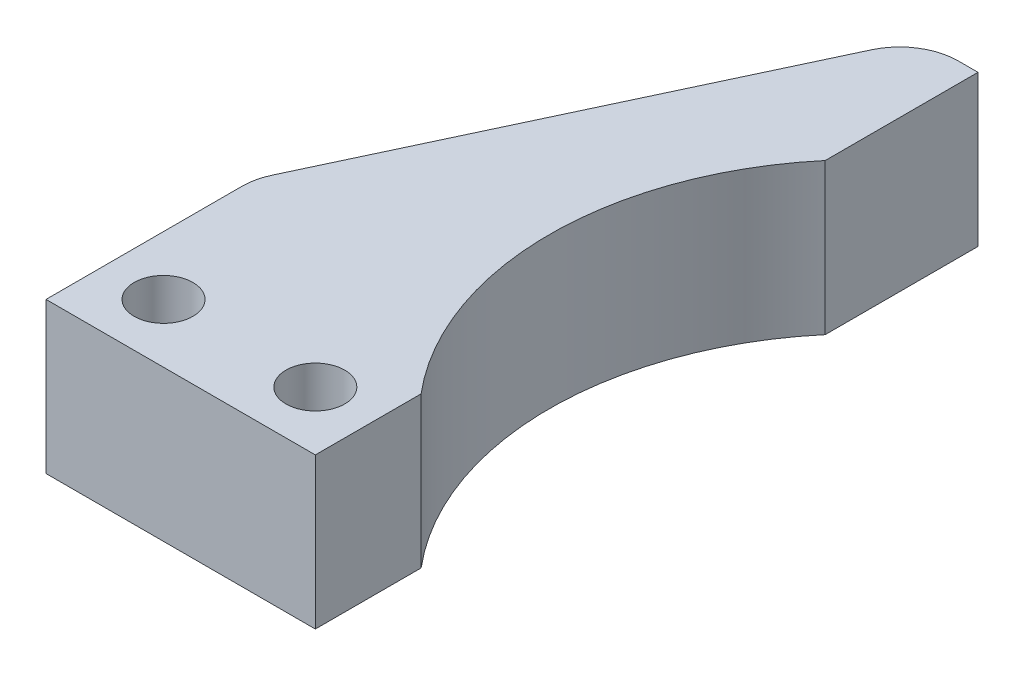
ISO-10303-21;
HEADER;
FILE_DESCRIPTION(('STEP AP214'),'2;1');
FILE_NAME('part.step','',(''),(''),'','','');
FILE_SCHEMA(('AUTOMOTIVE_DESIGN { 1 0 10303 214 1 1 1 1 }'));
ENDSEC;
DATA;
#1=APPLICATION_CONTEXT('core data for automotive mechanical design processes');
#2=APPLICATION_PROTOCOL_DEFINITION('international standard','automotive_design',2000,#1);
#3=PRODUCT_CONTEXT('',#1,'mechanical');
#4=PRODUCT('Part','Part','',(#3));
#5=PRODUCT_RELATED_PRODUCT_CATEGORY('part','',(#4));
#6=PRODUCT_DEFINITION_FORMATION('','',#4);
#7=PRODUCT_DEFINITION_CONTEXT('part definition',#1,'design');
#8=PRODUCT_DEFINITION('design','',#6,#7);
#9=PRODUCT_DEFINITION_SHAPE('','',#8);
#10=(LENGTH_UNIT() NAMED_UNIT(*) SI_UNIT(.MILLI.,.METRE.));
#11=(NAMED_UNIT(*) PLANE_ANGLE_UNIT() SI_UNIT($,.RADIAN.));
#12=(NAMED_UNIT(*) SI_UNIT($,.STERADIAN.) SOLID_ANGLE_UNIT());
#13=UNCERTAINTY_MEASURE_WITH_UNIT(LENGTH_MEASURE(1.E-05),#10,'distance_accuracy_value','');
#14=(GEOMETRIC_REPRESENTATION_CONTEXT(3) GLOBAL_UNCERTAINTY_ASSIGNED_CONTEXT((#13)) GLOBAL_UNIT_ASSIGNED_CONTEXT((#10,
#11,#12)) REPRESENTATION_CONTEXT('',''));
#15=CARTESIAN_POINT('',(0.,0.,0.));
#16=DIRECTION('',(0.,0.,1.));
#17=DIRECTION('',(1.,0.,0.));
#18=AXIS2_PLACEMENT_3D('',#15,#16,#17);
#19=CARTESIAN_POINT('',(-13.3014299379425,3.85,-6.22571671916805));
#20=DIRECTION('',(-0.905702893651664,0.,-0.423913043478261));
#21=DIRECTION('',(-0.423913043478261,0.,0.905702893651664));
#22=AXIS2_PLACEMENT_3D('',#19,#20,#21);
#23=PLANE('',#22);
#24=DIRECTION('',(0.423913043478261,0.,-0.905702893651664));
#25=VECTOR('',#24,1.);
#26=CARTESIAN_POINT('',(-13.3014299379425,-3.85,-6.22571671916805));
#27=LINE('',#26,#25);
#28=CARTESIAN_POINT('',(-13.467108680955,-3.85,-5.87173913043478));
#29=VERTEX_POINT('',#28);
#30=CARTESIAN_POINT('',(-3.71710868095499,-3.85,-26.7029056844231));
#31=VERTEX_POINT('',#30);
#32=EDGE_CURVE('E147',#29,#31,#27,.T.);
#33=ORIENTED_EDGE('',*,*,#32,.F.);
#34=DIRECTION('',(0.,-1.,0.));
#35=VECTOR('',#34,1.);
#36=CARTESIAN_POINT('',(-13.467108680955,3.85,-5.87173913043478));
#37=LINE('',#36,#35);
#38=CARTESIAN_POINT('',(-13.467108680955,3.85,-5.87173913043478));
#39=VERTEX_POINT('',#38);
#40=EDGE_CURVE('E11',#39,#29,#37,.T.);
#41=ORIENTED_EDGE('',*,*,#40,.F.);
#42=DIRECTION('',(0.423913043478261,0.,-0.905702893651664));
#43=VECTOR('',#42,1.);
#44=CARTESIAN_POINT('',(-13.3014299379425,3.85,-6.22571671916805));
#45=LINE('',#44,#43);
#46=CARTESIAN_POINT('',(-3.71710868095499,3.85,-26.7029056844231));
#47=VERTEX_POINT('',#46);
#48=EDGE_CURVE('E174',#39,#47,#45,.T.);
#49=ORIENTED_EDGE('',*,*,#48,.T.);
#50=DIRECTION('',(0.,-1.,0.));
#51=VECTOR('',#50,1.);
#52=CARTESIAN_POINT('',(-3.71710868095499,3.85,-26.7029056844231));
#53=LINE('',#52,#51);
#54=EDGE_CURVE('E58',#47,#31,#53,.T.);
#55=ORIENTED_EDGE('',*,*,#54,.T.);
#56=EDGE_LOOP('',(#33,#41,#49,#55));
#57=FACE_BOUND('',#56,.T.);
#58=ADVANCED_FACE('F42',(#57),#23,.T.);
#59=CARTESIAN_POINT('',(-10.75,3.85,-4.6));
#60=DIRECTION('',(0.,-1.,0.));
#61=DIRECTION('',(0.,0.,-1.));
#62=AXIS2_PLACEMENT_3D('',#59,#60,#61);
#63=CYLINDRICAL_SURFACE('',#62,3.);
#64=CARTESIAN_POINT('',(-10.75,-3.85,-4.6));
#65=DIRECTION('',(0.,1.,0.));
#66=DIRECTION('',(0.,0.,1.));
#67=AXIS2_PLACEMENT_3D('',#64,#65,#66);
#68=CIRCLE('',#67,3.);
#69=CARTESIAN_POINT('',(-13.75,-3.85,-4.6));
#70=VERTEX_POINT('',#69);
#71=EDGE_CURVE('E149',#70,#29,#68,.F.);
#72=ORIENTED_EDGE('',*,*,#71,.F.);
#73=DIRECTION('',(0.,-1.,0.));
#74=VECTOR('',#73,1.);
#75=CARTESIAN_POINT('',(-13.75,3.85,-4.6));
#76=LINE('',#75,#74);
#77=CARTESIAN_POINT('',(-13.75,3.85,-4.6));
#78=VERTEX_POINT('',#77);
#79=EDGE_CURVE('E50',#78,#70,#76,.T.);
#80=ORIENTED_EDGE('',*,*,#79,.F.);
#81=CARTESIAN_POINT('',(-10.75,3.85,-4.6));
#82=DIRECTION('',(0.,1.,0.));
#83=DIRECTION('',(0.,0.,1.));
#84=AXIS2_PLACEMENT_3D('',#81,#82,#83);
#85=CIRCLE('',#84,3.);
#86=EDGE_CURVE('E216',#78,#39,#85,.F.);
#87=ORIENTED_EDGE('',*,*,#86,.T.);
#88=ORIENTED_EDGE('',*,*,#40,.T.);
#89=EDGE_LOOP('',(#72,#80,#87,#88));
#90=FACE_BOUND('',#89,.T.);
#91=ADVANCED_FACE('F195',(#90),#63,.T.);
#92=CARTESIAN_POINT('',(-13.75,3.85,0.));
#93=DIRECTION('',(-1.,0.,0.));
#94=DIRECTION('',(0.,0.,1.));
#95=AXIS2_PLACEMENT_3D('',#92,#93,#94);
#96=PLANE('',#95);
#97=DIRECTION('',(0.,0.,-1.));
#98=VECTOR('',#97,1.);
#99=CARTESIAN_POINT('',(-13.75,-3.85,0.));
#100=LINE('',#99,#98);
#101=CARTESIAN_POINT('',(-13.75,-3.85,5.4));
#102=VERTEX_POINT('',#101);
#103=EDGE_CURVE('E152',#102,#70,#100,.T.);
#104=ORIENTED_EDGE('',*,*,#103,.F.);
#105=DIRECTION('',(0.,-1.,0.));
#106=VECTOR('',#105,1.);
#107=CARTESIAN_POINT('',(-13.75,3.85,5.4));
#108=LINE('',#107,#106);
#109=CARTESIAN_POINT('',(-13.75,3.85,5.4));
#110=VERTEX_POINT('',#109);
#111=EDGE_CURVE('E184',#110,#102,#108,.T.);
#112=ORIENTED_EDGE('',*,*,#111,.F.);
#113=DIRECTION('',(0.,0.,-1.));
#114=VECTOR('',#113,1.);
#115=CARTESIAN_POINT('',(-13.75,3.85,0.));
#116=LINE('',#115,#114);
#117=EDGE_CURVE('E191',#110,#78,#116,.T.);
#118=ORIENTED_EDGE('',*,*,#117,.T.);
#119=ORIENTED_EDGE('',*,*,#79,.T.);
#120=EDGE_LOOP('',(#104,#112,#118,#119));
#121=FACE_BOUND('',#120,.T.);
#122=ADVANCED_FACE('F189',(#121),#96,.T.);
#123=CARTESIAN_POINT('',(0.,3.85,5.4));
#124=DIRECTION('',(0.,0.,-1.));
#125=DIRECTION('',(-1.,0.,0.));
#126=AXIS2_PLACEMENT_3D('',#123,#124,#125);
#127=PLANE('',#126);
#128=DIRECTION('',(1.,0.,0.));
#129=VECTOR('',#128,1.);
#130=CARTESIAN_POINT('',(0.,-3.85,5.4));
#131=LINE('',#130,#129);
#132=CARTESIAN_POINT('',(0.,-3.85,5.4));
#133=VERTEX_POINT('',#132);
#134=EDGE_CURVE('E155',#102,#133,#131,.T.);
#135=ORIENTED_EDGE('',*,*,#134,.T.);
#136=DIRECTION('',(0.,-1.,0.));
#137=VECTOR('',#136,1.);
#138=CARTESIAN_POINT('',(0.,3.85,5.4));
#139=LINE('',#138,#137);
#140=CARTESIAN_POINT('',(0.,3.85,5.4));
#141=VERTEX_POINT('',#140);
#142=EDGE_CURVE('E181',#141,#133,#139,.T.);
#143=ORIENTED_EDGE('',*,*,#142,.F.);
#144=DIRECTION('',(1.,0.,0.));
#145=VECTOR('',#144,1.);
#146=CARTESIAN_POINT('',(0.,3.85,5.4));
#147=LINE('',#146,#145);
#148=EDGE_CURVE('E211',#110,#141,#147,.T.);
#149=ORIENTED_EDGE('',*,*,#148,.F.);
#150=ORIENTED_EDGE('',*,*,#111,.T.);
#151=EDGE_LOOP('',(#135,#143,#149,#150));
#152=FACE_BOUND('',#151,.T.);
#153=ADVANCED_FACE('F204',(#152),#127,.F.);
#154=CARTESIAN_POINT('',(0.,3.85,0.));
#155=DIRECTION('',(-1.,0.,0.));
#156=DIRECTION('',(0.,0.,1.));
#157=AXIS2_PLACEMENT_3D('',#154,#155,#156);
#158=PLANE('',#157);
#159=DIRECTION('',(0.,0.,-1.));
#160=VECTOR('',#159,1.);
#161=CARTESIAN_POINT('',(0.,-3.85,0.));
#162=LINE('',#161,#160);
#163=CARTESIAN_POINT('',(0.,-3.85,0.));
#164=VERTEX_POINT('',#163);
#165=EDGE_CURVE('E157',#133,#164,#162,.T.);
#166=ORIENTED_EDGE('',*,*,#165,.T.);
#167=DIRECTION('',(0.,-1.,0.));
#168=VECTOR('',#167,1.);
#169=CARTESIAN_POINT('',(0.,3.85,0.));
#170=LINE('',#169,#168);
#171=CARTESIAN_POINT('',(0.,3.85,0.));
#172=VERTEX_POINT('',#171);
#173=EDGE_CURVE('E178',#172,#164,#170,.T.);
#174=ORIENTED_EDGE('',*,*,#173,.F.);
#175=DIRECTION('',(0.,0.,-1.));
#176=VECTOR('',#175,1.);
#177=CARTESIAN_POINT('',(0.,3.85,0.));
#178=LINE('',#177,#176);
#179=EDGE_CURVE('E210',#141,#172,#178,.T.);
#180=ORIENTED_EDGE('',*,*,#179,.F.);
#181=ORIENTED_EDGE('',*,*,#142,.T.);
#182=EDGE_LOOP('',(#166,#174,#180,#181));
#183=FACE_BOUND('',#182,.T.);
#184=ADVANCED_FACE('F208',(#183),#158,.F.);
#185=CARTESIAN_POINT('',(12.2306476384286,3.85,-10.3155832769941));
#186=DIRECTION('',(0.,-1.,0.));
#187=DIRECTION('',(0.,0.,-1.));
#188=AXIS2_PLACEMENT_3D('',#185,#186,#187);
#189=CYLINDRICAL_SURFACE('',#188,16.);
#190=CARTESIAN_POINT('',(12.2306476384286,-3.85,-10.3155832769941));
#191=DIRECTION('',(0.,1.,0.));
#192=DIRECTION('',(0.,0.,1.));
#193=AXIS2_PLACEMENT_3D('',#190,#191,#192);
#194=CIRCLE('',#193,16.);
#195=CARTESIAN_POINT('',(0.,-3.85,-20.6311665539883));
#196=VERTEX_POINT('',#195);
#197=EDGE_CURVE('E159',#164,#196,#194,.F.);
#198=ORIENTED_EDGE('',*,*,#197,.T.);
#199=DIRECTION('',(0.,-1.,0.));
#200=VECTOR('',#199,1.);
#201=CARTESIAN_POINT('',(0.,3.85,-20.6311665539883));
#202=LINE('',#201,#200);
#203=CARTESIAN_POINT('',(0.,3.85,-20.6311665539883));
#204=VERTEX_POINT('',#203);
#205=EDGE_CURVE('E123',#204,#196,#202,.T.);
#206=ORIENTED_EDGE('',*,*,#205,.F.);
#207=CARTESIAN_POINT('',(12.2306476384286,3.85,-10.3155832769941));
#208=DIRECTION('',(0.,1.,0.));
#209=DIRECTION('',(0.,0.,1.));
#210=AXIS2_PLACEMENT_3D('',#207,#208,#209);
#211=CIRCLE('',#210,16.);
#212=EDGE_CURVE('E132',#172,#204,#211,.F.);
#213=ORIENTED_EDGE('',*,*,#212,.F.);
#214=ORIENTED_EDGE('',*,*,#173,.T.);
#215=EDGE_LOOP('',(#198,#206,#213,#214));
#216=FACE_BOUND('',#215,.T.);
#217=ADVANCED_FACE('F245',(#216),#189,.F.);
#218=CARTESIAN_POINT('',(0.,3.85,0.));
#219=DIRECTION('',(1.,0.,0.));
#220=DIRECTION('',(0.,0.,-1.));
#221=AXIS2_PLACEMENT_3D('',#218,#219,#220);
#222=PLANE('',#221);
#223=DIRECTION('',(0.,0.,1.));
#224=VECTOR('',#223,1.);
#225=CARTESIAN_POINT('',(0.,-3.85,0.));
#226=LINE('',#225,#224);
#227=CARTESIAN_POINT('',(0.,-3.85,-28.4311665539883));
#228=VERTEX_POINT('',#227);
#229=EDGE_CURVE('E119',#228,#196,#226,.T.);
#230=ORIENTED_EDGE('',*,*,#229,.F.);
#231=DIRECTION('',(0.,-1.,0.));
#232=VECTOR('',#231,1.);
#233=CARTESIAN_POINT('',(0.,3.85,-28.4311665539883));
#234=LINE('',#233,#232);
#235=CARTESIAN_POINT('',(0.,3.85,-28.4311665539883));
#236=VERTEX_POINT('',#235);
#237=EDGE_CURVE('E114',#236,#228,#234,.T.);
#238=ORIENTED_EDGE('',*,*,#237,.F.);
#239=DIRECTION('',(0.,0.,1.));
#240=VECTOR('',#239,1.);
#241=CARTESIAN_POINT('',(0.,3.85,0.));
#242=LINE('',#241,#240);
#243=EDGE_CURVE('E117',#236,#204,#242,.T.);
#244=ORIENTED_EDGE('',*,*,#243,.T.);
#245=ORIENTED_EDGE('',*,*,#205,.T.);
#246=EDGE_LOOP('',(#230,#238,#244,#245));
#247=FACE_BOUND('',#246,.T.);
#248=ADVANCED_FACE('F116',(#247),#222,.T.);
#249=CARTESIAN_POINT('',(0.,3.85,-28.4311665539883));
#250=DIRECTION('',(0.,0.,-1.));
#251=DIRECTION('',(-1.,0.,0.));
#252=AXIS2_PLACEMENT_3D('',#249,#250,#251);
#253=PLANE('',#252);
#254=DIRECTION('',(1.,0.,0.));
#255=VECTOR('',#254,1.);
#256=CARTESIAN_POINT('',(0.,-3.85,-28.4311665539883));
#257=LINE('',#256,#255);
#258=CARTESIAN_POINT('',(-1.,-3.85,-28.4311665539883));
#259=VERTEX_POINT('',#258);
#260=EDGE_CURVE('E163',#259,#228,#257,.T.);
#261=ORIENTED_EDGE('',*,*,#260,.F.);
#262=DIRECTION('',(0.,-1.,0.));
#263=VECTOR('',#262,1.);
#264=CARTESIAN_POINT('',(-1.,3.85,-28.4311665539883));
#265=LINE('',#264,#263);
#266=CARTESIAN_POINT('',(-1.,3.85,-28.4311665539883));
#267=VERTEX_POINT('',#266);
#268=EDGE_CURVE('E86',#267,#259,#265,.T.);
#269=ORIENTED_EDGE('',*,*,#268,.F.);
#270=DIRECTION('',(1.,0.,0.));
#271=VECTOR('',#270,1.);
#272=CARTESIAN_POINT('',(0.,3.85,-28.4311665539883));
#273=LINE('',#272,#271);
#274=EDGE_CURVE('E130',#267,#236,#273,.T.);
#275=ORIENTED_EDGE('',*,*,#274,.T.);
#276=ORIENTED_EDGE('',*,*,#237,.T.);
#277=EDGE_LOOP('',(#261,#269,#275,#276));
#278=FACE_BOUND('',#277,.T.);
#279=ADVANCED_FACE('F135',(#278),#253,.T.);
#280=CARTESIAN_POINT('',(-3.,3.85,2.4));
#281=DIRECTION('',(0.,-1.,0.));
#282=DIRECTION('',(0.,0.,-1.));
#283=AXIS2_PLACEMENT_3D('',#280,#281,#282);
#284=CYLINDRICAL_SURFACE('',#283,1.5);
#285=CARTESIAN_POINT('',(-3.,3.85,2.4));
#286=DIRECTION('',(0.,1.,0.));
#287=DIRECTION('',(0.,0.,1.));
#288=AXIS2_PLACEMENT_3D('',#285,#286,#287);
#289=CIRCLE('',#288,1.5);
#290=CARTESIAN_POINT('',(-3.,3.85,3.9));
#291=VERTEX_POINT('',#290);
#292=EDGE_CURVE('E138',#291,#291,#289,.F.);
#293=ORIENTED_EDGE('',*,*,#292,.F.);
#294=EDGE_LOOP('',(#293));
#295=FACE_BOUND('',#294,.T.);
#296=CARTESIAN_POINT('',(-3.,-3.85,2.4));
#297=DIRECTION('',(0.,1.,0.));
#298=DIRECTION('',(0.,0.,1.));
#299=AXIS2_PLACEMENT_3D('',#296,#297,#298);
#300=CIRCLE('',#299,1.5);
#301=CARTESIAN_POINT('',(-3.,-3.85,3.9));
#302=VERTEX_POINT('',#301);
#303=EDGE_CURVE('E168',#302,#302,#300,.F.);
#304=ORIENTED_EDGE('',*,*,#303,.T.);
#305=EDGE_LOOP('',(#304));
#306=FACE_BOUND('',#305,.T.);
#307=ADVANCED_FACE('F221',(#295,#306),#284,.F.);
#308=CARTESIAN_POINT('',(-1.,3.85,-25.4311665539883));
#309=DIRECTION('',(0.,-1.,0.));
#310=DIRECTION('',(0.,0.,-1.));
#311=AXIS2_PLACEMENT_3D('',#308,#309,#310);
#312=CYLINDRICAL_SURFACE('',#311,3.);
#313=CARTESIAN_POINT('',(-1.,-3.85,-25.4311665539883));
#314=DIRECTION('',(0.,1.,0.));
#315=DIRECTION('',(0.,0.,1.));
#316=AXIS2_PLACEMENT_3D('',#313,#314,#315);
#317=CIRCLE('',#316,3.);
#318=EDGE_CURVE('E165',#31,#259,#317,.F.);
#319=ORIENTED_EDGE('',*,*,#318,.F.);
#320=ORIENTED_EDGE('',*,*,#54,.F.);
#321=CARTESIAN_POINT('',(-1.,3.85,-25.4311665539883));
#322=DIRECTION('',(0.,1.,0.));
#323=DIRECTION('',(0.,0.,1.));
#324=AXIS2_PLACEMENT_3D('',#321,#322,#323);
#325=CIRCLE('',#324,3.);
#326=EDGE_CURVE('E136',#47,#267,#325,.F.);
#327=ORIENTED_EDGE('',*,*,#326,.T.);
#328=ORIENTED_EDGE('',*,*,#268,.T.);
#329=EDGE_LOOP('',(#319,#320,#327,#328));
#330=FACE_BOUND('',#329,.T.);
#331=ADVANCED_FACE('F218',(#330),#312,.T.);
#332=CARTESIAN_POINT('',(-10.75,3.85,2.4));
#333=DIRECTION('',(0.,-1.,0.));
#334=DIRECTION('',(0.,0.,-1.));
#335=AXIS2_PLACEMENT_3D('',#332,#333,#334);
#336=CYLINDRICAL_SURFACE('',#335,1.5);
#337=CARTESIAN_POINT('',(-10.75,3.85,2.4));
#338=DIRECTION('',(0.,1.,0.));
#339=DIRECTION('',(0.,0.,1.));
#340=AXIS2_PLACEMENT_3D('',#337,#338,#339);
#341=CIRCLE('',#340,1.5);
#342=CARTESIAN_POINT('',(-10.75,3.85,3.9));
#343=VERTEX_POINT('',#342);
#344=EDGE_CURVE('E144',#343,#343,#341,.T.);
#345=ORIENTED_EDGE('',*,*,#344,.T.);
#346=EDGE_LOOP('',(#345));
#347=FACE_BOUND('',#346,.T.);
#348=CARTESIAN_POINT('',(-10.75,-3.85,2.4));
#349=DIRECTION('',(0.,1.,0.));
#350=DIRECTION('',(0.,0.,1.));
#351=AXIS2_PLACEMENT_3D('',#348,#349,#350);
#352=CIRCLE('',#351,1.5);
#353=CARTESIAN_POINT('',(-10.75,-3.85,3.9));
#354=VERTEX_POINT('',#353);
#355=EDGE_CURVE('E171',#354,#354,#352,.T.);
#356=ORIENTED_EDGE('',*,*,#355,.F.);
#357=EDGE_LOOP('',(#356));
#358=FACE_BOUND('',#357,.T.);
#359=ADVANCED_FACE('F220',(#347,#358),#336,.F.);
#360=CARTESIAN_POINT('',(0.,3.85,0.));
#361=DIRECTION('',(0.,1.,0.));
#362=DIRECTION('',(0.,0.,1.));
#363=AXIS2_PLACEMENT_3D('',#360,#361,#362);
#364=PLANE('',#363);
#365=ORIENTED_EDGE('',*,*,#48,.F.);
#366=ORIENTED_EDGE('',*,*,#86,.F.);
#367=ORIENTED_EDGE('',*,*,#117,.F.);
#368=ORIENTED_EDGE('',*,*,#148,.T.);
#369=ORIENTED_EDGE('',*,*,#179,.T.);
#370=ORIENTED_EDGE('',*,*,#212,.T.);
#371=ORIENTED_EDGE('',*,*,#243,.F.);
#372=ORIENTED_EDGE('',*,*,#274,.F.);
#373=ORIENTED_EDGE('',*,*,#326,.F.);
#374=EDGE_LOOP('',(#365,#366,#367,#368,#369,#370,#371,#372,#373));
#375=FACE_BOUND('',#374,.T.);
#376=ORIENTED_EDGE('',*,*,#292,.T.);
#377=EDGE_LOOP('',(#376));
#378=FACE_BOUND('',#377,.T.);
#379=ORIENTED_EDGE('',*,*,#344,.F.);
#380=EDGE_LOOP('',(#379));
#381=FACE_BOUND('',#380,.T.);
#382=ADVANCED_FACE('F127',(#375,#378,#381),#364,.T.);
#383=CARTESIAN_POINT('',(0.,-3.85,0.));
#384=DIRECTION('',(0.,1.,0.));
#385=DIRECTION('',(0.,0.,1.));
#386=AXIS2_PLACEMENT_3D('',#383,#384,#385);
#387=PLANE('',#386);
#388=ORIENTED_EDGE('',*,*,#32,.T.);
#389=ORIENTED_EDGE('',*,*,#318,.T.);
#390=ORIENTED_EDGE('',*,*,#260,.T.);
#391=ORIENTED_EDGE('',*,*,#229,.T.);
#392=ORIENTED_EDGE('',*,*,#197,.F.);
#393=ORIENTED_EDGE('',*,*,#165,.F.);
#394=ORIENTED_EDGE('',*,*,#134,.F.);
#395=ORIENTED_EDGE('',*,*,#103,.T.);
#396=ORIENTED_EDGE('',*,*,#71,.T.);
#397=EDGE_LOOP('',(#388,#389,#390,#391,#392,#393,#394,#395,#396));
#398=FACE_BOUND('',#397,.T.);
#399=ORIENTED_EDGE('',*,*,#303,.F.);
#400=EDGE_LOOP('',(#399));
#401=FACE_BOUND('',#400,.T.);
#402=ORIENTED_EDGE('',*,*,#355,.T.);
#403=EDGE_LOOP('',(#402));
#404=FACE_BOUND('',#403,.T.);
#405=ADVANCED_FACE('F198',(#398,#401,#404),#387,.F.);
#406=CLOSED_SHELL('',(#58,#91,#122,#153,#184,#217,#248,#279,#307,#331,#359,#382,#405));
#407=MANIFOLD_SOLID_BREP('B2',#406);
#408=ADVANCED_BREP_SHAPE_REPRESENTATION('',(#18,#407),#14);
#409=SHAPE_DEFINITION_REPRESENTATION(#9,#408);
ENDSEC;
END-ISO-10303-21;
